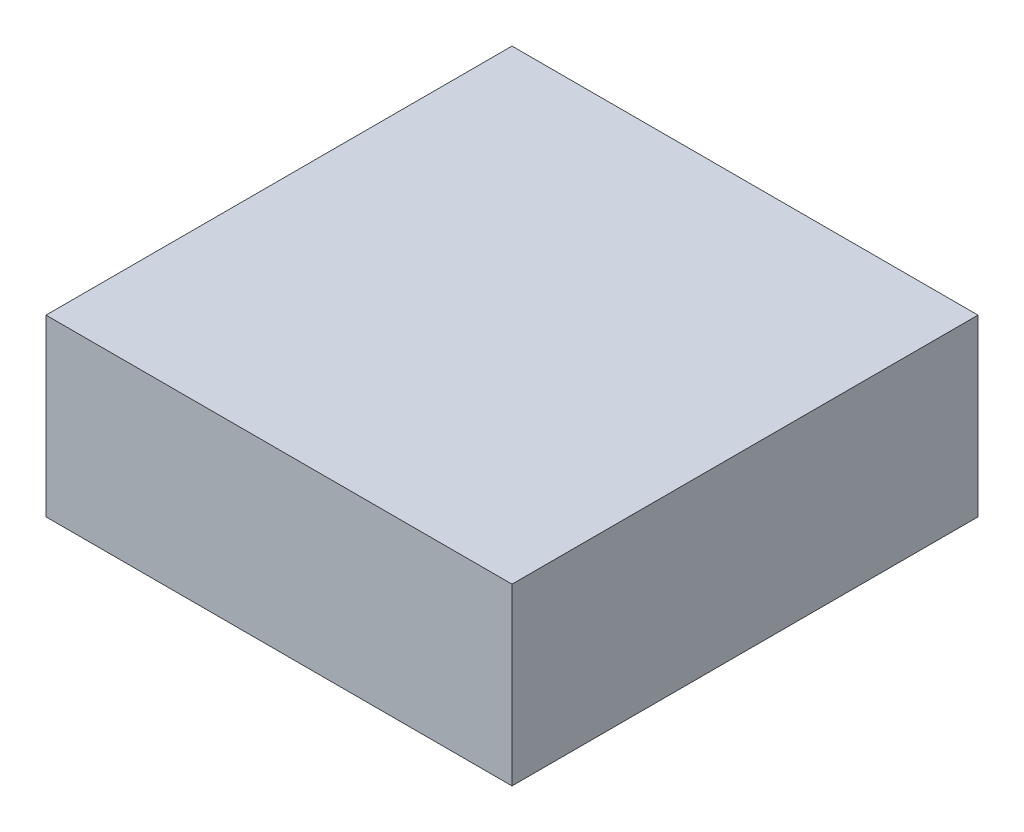
ISO-10303-21;
HEADER;
FILE_DESCRIPTION(('STEP AP214'),'2;1');
FILE_NAME('part.step','',(''),(''),'','','');
FILE_SCHEMA(('AUTOMOTIVE_DESIGN { 1 0 10303 214 1 1 1 1 }'));
ENDSEC;
DATA;
#1=APPLICATION_CONTEXT('core data for automotive mechanical design processes');
#2=APPLICATION_PROTOCOL_DEFINITION('international standard','automotive_design',2000,#1);
#3=PRODUCT_CONTEXT('',#1,'mechanical');
#4=PRODUCT('Part','Part','',(#3));
#5=PRODUCT_RELATED_PRODUCT_CATEGORY('part','',(#4));
#6=PRODUCT_DEFINITION_FORMATION('','',#4);
#7=PRODUCT_DEFINITION_CONTEXT('part definition',#1,'design');
#8=PRODUCT_DEFINITION('design','',#6,#7);
#9=PRODUCT_DEFINITION_SHAPE('','',#8);
#10=(LENGTH_UNIT() NAMED_UNIT(*) SI_UNIT(.MILLI.,.METRE.));
#11=(NAMED_UNIT(*) PLANE_ANGLE_UNIT() SI_UNIT($,.RADIAN.));
#12=(NAMED_UNIT(*) SI_UNIT($,.STERADIAN.) SOLID_ANGLE_UNIT());
#13=UNCERTAINTY_MEASURE_WITH_UNIT(LENGTH_MEASURE(1.E-05),#10,'distance_accuracy_value','');
#14=(GEOMETRIC_REPRESENTATION_CONTEXT(3) GLOBAL_UNCERTAINTY_ASSIGNED_CONTEXT((#13)) GLOBAL_UNIT_ASSIGNED_CONTEXT((#10,
#11,#12)) REPRESENTATION_CONTEXT('',''));
#15=CARTESIAN_POINT('',(0.,0.,0.));
#16=DIRECTION('',(0.,0.,1.));
#17=DIRECTION('',(1.,0.,0.));
#18=AXIS2_PLACEMENT_3D('',#15,#16,#17);
#19=CARTESIAN_POINT('',(609.6,457.2,609.6));
#20=DIRECTION('',(-1.,0.,0.));
#21=DIRECTION('',(0.,0.,1.));
#22=AXIS2_PLACEMENT_3D('',#19,#20,#21);
#23=PLANE('',#22);
#24=DIRECTION('',(0.,0.,-1.));
#25=VECTOR('',#24,1.);
#26=CARTESIAN_POINT('',(609.6,0.,609.6));
#27=LINE('',#26,#25);
#28=CARTESIAN_POINT('',(609.6,0.,609.6));
#29=VERTEX_POINT('',#28);
#30=CARTESIAN_POINT('',(609.6,0.,-609.6));
#31=VERTEX_POINT('',#30);
#32=EDGE_CURVE('E95',#29,#31,#27,.T.);
#33=ORIENTED_EDGE('',*,*,#32,.T.);
#34=DIRECTION('',(0.,-1.,0.));
#35=VECTOR('',#34,1.);
#36=CARTESIAN_POINT('',(609.6,457.2,-609.6));
#37=LINE('',#36,#35);
#38=CARTESIAN_POINT('',(609.6,457.2,-609.6));
#39=VERTEX_POINT('',#38);
#40=EDGE_CURVE('E11',#39,#31,#37,.T.);
#41=ORIENTED_EDGE('',*,*,#40,.F.);
#42=DIRECTION('',(0.,0.,-1.));
#43=VECTOR('',#42,1.);
#44=CARTESIAN_POINT('',(609.6,457.2,609.6));
#45=LINE('',#44,#43);
#46=CARTESIAN_POINT('',(609.6,457.2,609.6));
#47=VERTEX_POINT('',#46);
#48=EDGE_CURVE('E83',#47,#39,#45,.T.);
#49=ORIENTED_EDGE('',*,*,#48,.F.);
#50=DIRECTION('',(0.,-1.,0.));
#51=VECTOR('',#50,1.);
#52=CARTESIAN_POINT('',(609.6,457.2,609.6));
#53=LINE('',#52,#51);
#54=EDGE_CURVE('E91',#47,#29,#53,.T.);
#55=ORIENTED_EDGE('',*,*,#54,.T.);
#56=EDGE_LOOP('',(#33,#41,#49,#55));
#57=FACE_BOUND('',#56,.T.);
#58=ADVANCED_FACE('F32',(#57),#23,.F.);
#59=CARTESIAN_POINT('',(-609.6,457.2,-609.6));
#60=DIRECTION('',(0.,0.,1.));
#61=DIRECTION('',(1.,0.,0.));
#62=AXIS2_PLACEMENT_3D('',#59,#60,#61);
#63=PLANE('',#62);
#64=DIRECTION('',(-1.,0.,0.));
#65=VECTOR('',#64,1.);
#66=CARTESIAN_POINT('',(-609.6,0.,-609.6));
#67=LINE('',#66,#65);
#68=CARTESIAN_POINT('',(-609.6,0.,-609.6));
#69=VERTEX_POINT('',#68);
#70=EDGE_CURVE('E87',#31,#69,#67,.T.);
#71=ORIENTED_EDGE('',*,*,#70,.T.);
#72=DIRECTION('',(0.,-1.,0.));
#73=VECTOR('',#72,1.);
#74=CARTESIAN_POINT('',(-609.6,457.2,-609.6));
#75=LINE('',#74,#73);
#76=CARTESIAN_POINT('',(-609.6,457.2,-609.6));
#77=VERTEX_POINT('',#76);
#78=EDGE_CURVE('E40',#77,#69,#75,.T.);
#79=ORIENTED_EDGE('',*,*,#78,.F.);
#80=DIRECTION('',(-1.,0.,0.));
#81=VECTOR('',#80,1.);
#82=CARTESIAN_POINT('',(-609.6,457.2,-609.6));
#83=LINE('',#82,#81);
#84=EDGE_CURVE('E78',#39,#77,#83,.T.);
#85=ORIENTED_EDGE('',*,*,#84,.F.);
#86=ORIENTED_EDGE('',*,*,#40,.T.);
#87=EDGE_LOOP('',(#71,#79,#85,#86));
#88=FACE_BOUND('',#87,.T.);
#89=ADVANCED_FACE('F86',(#88),#63,.F.);
#90=CARTESIAN_POINT('',(-609.6,457.2,609.6));
#91=DIRECTION('',(1.,0.,0.));
#92=DIRECTION('',(0.,0.,-1.));
#93=AXIS2_PLACEMENT_3D('',#90,#91,#92);
#94=PLANE('',#93);
#95=DIRECTION('',(0.,0.,1.));
#96=VECTOR('',#95,1.);
#97=CARTESIAN_POINT('',(-609.6,0.,609.6));
#98=LINE('',#97,#96);
#99=CARTESIAN_POINT('',(-609.6,0.,609.6));
#100=VERTEX_POINT('',#99);
#101=EDGE_CURVE('E65',#69,#100,#98,.T.);
#102=ORIENTED_EDGE('',*,*,#101,.T.);
#103=DIRECTION('',(0.,-1.,0.));
#104=VECTOR('',#103,1.);
#105=CARTESIAN_POINT('',(-609.6,457.2,609.6));
#106=LINE('',#105,#104);
#107=CARTESIAN_POINT('',(-609.6,457.2,609.6));
#108=VERTEX_POINT('',#107);
#109=EDGE_CURVE('E88',#108,#100,#106,.T.);
#110=ORIENTED_EDGE('',*,*,#109,.F.);
#111=DIRECTION('',(0.,0.,1.));
#112=VECTOR('',#111,1.);
#113=CARTESIAN_POINT('',(-609.6,457.2,609.6));
#114=LINE('',#113,#112);
#115=EDGE_CURVE('E81',#77,#108,#114,.T.);
#116=ORIENTED_EDGE('',*,*,#115,.F.);
#117=ORIENTED_EDGE('',*,*,#78,.T.);
#118=EDGE_LOOP('',(#102,#110,#116,#117));
#119=FACE_BOUND('',#118,.T.);
#120=ADVANCED_FACE('F89',(#119),#94,.F.);
#121=CARTESIAN_POINT('',(-609.6,457.2,609.6));
#122=DIRECTION('',(0.,0.,-1.));
#123=DIRECTION('',(-1.,0.,0.));
#124=AXIS2_PLACEMENT_3D('',#121,#122,#123);
#125=PLANE('',#124);
#126=DIRECTION('',(1.,0.,0.));
#127=VECTOR('',#126,1.);
#128=CARTESIAN_POINT('',(-609.6,0.,609.6));
#129=LINE('',#128,#127);
#130=EDGE_CURVE('E71',#100,#29,#129,.T.);
#131=ORIENTED_EDGE('',*,*,#130,.T.);
#132=ORIENTED_EDGE('',*,*,#54,.F.);
#133=DIRECTION('',(1.,0.,0.));
#134=VECTOR('',#133,1.);
#135=CARTESIAN_POINT('',(-609.6,457.2,609.6));
#136=LINE('',#135,#134);
#137=EDGE_CURVE('E48',#108,#47,#136,.T.);
#138=ORIENTED_EDGE('',*,*,#137,.F.);
#139=ORIENTED_EDGE('',*,*,#109,.T.);
#140=EDGE_LOOP('',(#131,#132,#138,#139));
#141=FACE_BOUND('',#140,.T.);
#142=ADVANCED_FACE('F102',(#141),#125,.F.);
#143=CARTESIAN_POINT('',(0.,457.2,0.));
#144=DIRECTION('',(0.,-1.,0.));
#145=DIRECTION('',(0.,0.,-1.));
#146=AXIS2_PLACEMENT_3D('',#143,#144,#145);
#147=PLANE('',#146);
#148=ORIENTED_EDGE('',*,*,#48,.T.);
#149=ORIENTED_EDGE('',*,*,#84,.T.);
#150=ORIENTED_EDGE('',*,*,#115,.T.);
#151=ORIENTED_EDGE('',*,*,#137,.T.);
#152=EDGE_LOOP('',(#148,#149,#150,#151));
#153=FACE_BOUND('',#152,.T.);
#154=ADVANCED_FACE('F79',(#153),#147,.F.);
#155=CARTESIAN_POINT('',(0.,0.,0.));
#156=DIRECTION('',(0.,-1.,0.));
#157=DIRECTION('',(0.,0.,-1.));
#158=AXIS2_PLACEMENT_3D('',#155,#156,#157);
#159=PLANE('',#158);
#160=ORIENTED_EDGE('',*,*,#32,.F.);
#161=ORIENTED_EDGE('',*,*,#130,.F.);
#162=ORIENTED_EDGE('',*,*,#101,.F.);
#163=ORIENTED_EDGE('',*,*,#70,.F.);
#164=EDGE_LOOP('',(#160,#161,#162,#163));
#165=FACE_BOUND('',#164,.T.);
#166=ADVANCED_FACE('F105',(#165),#159,.T.);
#167=CLOSED_SHELL('',(#58,#89,#120,#142,#154,#166));
#168=MANIFOLD_SOLID_BREP('B2',#167);
#169=ADVANCED_BREP_SHAPE_REPRESENTATION('',(#18,#168),#14);
#170=SHAPE_DEFINITION_REPRESENTATION(#9,#169);
ENDSEC;
END-ISO-10303-21;
